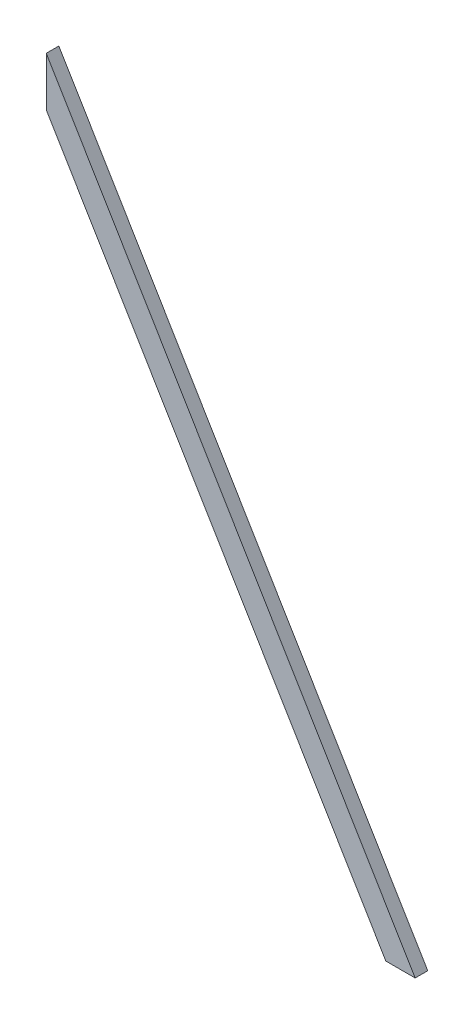
ISO-10303-21;
HEADER;
FILE_DESCRIPTION(('STEP AP214'),'2;1');
FILE_NAME('part.step','',(''),(''),'','','');
FILE_SCHEMA(('AUTOMOTIVE_DESIGN { 1 0 10303 214 1 1 1 1 }'));
ENDSEC;
DATA;
#1=APPLICATION_CONTEXT('core data for automotive mechanical design processes');
#2=APPLICATION_PROTOCOL_DEFINITION('international standard','automotive_design',2000,#1);
#3=PRODUCT_CONTEXT('',#1,'mechanical');
#4=PRODUCT('Part','Part','',(#3));
#5=PRODUCT_RELATED_PRODUCT_CATEGORY('part','',(#4));
#6=PRODUCT_DEFINITION_FORMATION('','',#4);
#7=PRODUCT_DEFINITION_CONTEXT('part definition',#1,'design');
#8=PRODUCT_DEFINITION('design','',#6,#7);
#9=PRODUCT_DEFINITION_SHAPE('','',#8);
#10=(LENGTH_UNIT() NAMED_UNIT(*) SI_UNIT(.MILLI.,.METRE.));
#11=(NAMED_UNIT(*) PLANE_ANGLE_UNIT() SI_UNIT($,.RADIAN.));
#12=(NAMED_UNIT(*) SI_UNIT($,.STERADIAN.) SOLID_ANGLE_UNIT());
#13=UNCERTAINTY_MEASURE_WITH_UNIT(LENGTH_MEASURE(1.E-05),#10,'distance_accuracy_value','');
#14=(GEOMETRIC_REPRESENTATION_CONTEXT(3) GLOBAL_UNCERTAINTY_ASSIGNED_CONTEXT((#13)) GLOBAL_UNIT_ASSIGNED_CONTEXT((#10,
#11,#12)) REPRESENTATION_CONTEXT('',''));
#15=CARTESIAN_POINT('',(0.,0.,0.));
#16=DIRECTION('',(0.,0.,1.));
#17=DIRECTION('',(1.,0.,0.));
#18=AXIS2_PLACEMENT_3D('',#15,#16,#17);
#19=CARTESIAN_POINT('',(-18.796,933.686763033529,-19.05));
#20=DIRECTION('',(-1.,0.,0.));
#21=DIRECTION('',(0.,0.,1.));
#22=AXIS2_PLACEMENT_3D('',#19,#20,#21);
#23=PLANE('',#22);
#24=DIRECTION('',(0.,-1.,0.));
#25=VECTOR('',#24,1.);
#26=CARTESIAN_POINT('',(-18.796,933.686763033529,0.));
#27=LINE('',#26,#25);
#28=CARTESIAN_POINT('',(-18.796,933.686763033529,0.));
#29=VERTEX_POINT('',#28);
#30=CARTESIAN_POINT('',(-18.796,859.496033764355,0.));
#31=VERTEX_POINT('',#30);
#32=EDGE_CURVE('E111',#29,#31,#27,.T.);
#33=ORIENTED_EDGE('',*,*,#32,.F.);
#34=DIRECTION('',(0.,0.,1.));
#35=VECTOR('',#34,1.);
#36=CARTESIAN_POINT('',(-18.796,933.686763033529,-19.05));
#37=LINE('',#36,#35);
#38=CARTESIAN_POINT('',(-18.796,933.686763033529,-19.05));
#39=VERTEX_POINT('',#38);
#40=EDGE_CURVE('E11',#39,#29,#37,.T.);
#41=ORIENTED_EDGE('',*,*,#40,.F.);
#42=DIRECTION('',(0.,-1.,0.));
#43=VECTOR('',#42,1.);
#44=CARTESIAN_POINT('',(-18.796,933.686763033529,-19.05));
#45=LINE('',#44,#43);
#46=CARTESIAN_POINT('',(-18.796,859.496033764355,-19.05));
#47=VERTEX_POINT('',#46);
#48=EDGE_CURVE('E103',#39,#47,#45,.T.);
#49=ORIENTED_EDGE('',*,*,#48,.T.);
#50=DIRECTION('',(0.,0.,1.));
#51=VECTOR('',#50,1.);
#52=CARTESIAN_POINT('',(-18.796,859.496033764355,-19.05));
#53=LINE('',#52,#51);
#54=EDGE_CURVE('E44',#47,#31,#53,.T.);
#55=ORIENTED_EDGE('',*,*,#54,.T.);
#56=EDGE_LOOP('',(#33,#41,#49,#55));
#57=FACE_BOUND('',#56,.T.);
#58=ADVANCED_FACE('F41',(#57),#23,.T.);
#59=CARTESIAN_POINT('',(540.004,0.,-19.05));
#60=DIRECTION('',(0.858064905723647,0.513541252058165,0.));
#61=DIRECTION('',(-0.513541252058165,0.858064905723647,0.));
#62=AXIS2_PLACEMENT_3D('',#59,#60,#61);
#63=PLANE('',#62);
#64=DIRECTION('',(-0.513541252058165,0.858064905723647,0.));
#65=VECTOR('',#64,1.);
#66=CARTESIAN_POINT('',(540.004,0.,0.));
#67=LINE('',#66,#65);
#68=CARTESIAN_POINT('',(540.004,0.,0.));
#69=VERTEX_POINT('',#68);
#70=EDGE_CURVE('E106',#69,#29,#67,.T.);
#71=ORIENTED_EDGE('',*,*,#70,.F.);
#72=DIRECTION('',(0.,0.,1.));
#73=VECTOR('',#72,1.);
#74=CARTESIAN_POINT('',(540.004,0.,-19.05));
#75=LINE('',#74,#73);
#76=CARTESIAN_POINT('',(540.004,0.,-19.05));
#77=VERTEX_POINT('',#76);
#78=EDGE_CURVE('E51',#77,#69,#75,.T.);
#79=ORIENTED_EDGE('',*,*,#78,.F.);
#80=DIRECTION('',(-0.513541252058165,0.858064905723647,0.));
#81=VECTOR('',#80,1.);
#82=CARTESIAN_POINT('',(540.004,0.,-19.05));
#83=LINE('',#82,#81);
#84=EDGE_CURVE('E98',#77,#39,#83,.T.);
#85=ORIENTED_EDGE('',*,*,#84,.T.);
#86=ORIENTED_EDGE('',*,*,#40,.T.);
#87=EDGE_LOOP('',(#71,#79,#85,#86));
#88=FACE_BOUND('',#87,.T.);
#89=ADVANCED_FACE('F127',(#88),#63,.T.);
#90=CARTESIAN_POINT('',(495.601764521241,0.,-19.05));
#91=DIRECTION('',(0.,-1.,0.));
#92=DIRECTION('',(0.,0.,-1.));
#93=AXIS2_PLACEMENT_3D('',#90,#91,#92);
#94=PLANE('',#93);
#95=DIRECTION('',(1.,0.,0.));
#96=VECTOR('',#95,1.);
#97=CARTESIAN_POINT('',(495.601764521241,0.,0.));
#98=LINE('',#97,#96);
#99=CARTESIAN_POINT('',(495.601764521241,0.,0.));
#100=VERTEX_POINT('',#99);
#101=EDGE_CURVE('E92',#100,#69,#98,.T.);
#102=ORIENTED_EDGE('',*,*,#101,.F.);
#103=DIRECTION('',(0.,0.,1.));
#104=VECTOR('',#103,1.);
#105=CARTESIAN_POINT('',(495.601764521241,0.,-19.05));
#106=LINE('',#105,#104);
#107=CARTESIAN_POINT('',(495.601764521241,0.,-19.05));
#108=VERTEX_POINT('',#107);
#109=EDGE_CURVE('E87',#108,#100,#106,.T.);
#110=ORIENTED_EDGE('',*,*,#109,.F.);
#111=DIRECTION('',(1.,0.,0.));
#112=VECTOR('',#111,1.);
#113=CARTESIAN_POINT('',(495.601764521241,0.,-19.05));
#114=LINE('',#113,#112);
#115=EDGE_CURVE('E90',#108,#77,#114,.T.);
#116=ORIENTED_EDGE('',*,*,#115,.T.);
#117=ORIENTED_EDGE('',*,*,#78,.T.);
#118=EDGE_LOOP('',(#102,#110,#116,#117));
#119=FACE_BOUND('',#118,.T.);
#120=ADVANCED_FACE('F89',(#119),#94,.T.);
#121=CARTESIAN_POINT('',(-18.796,859.496033764355,-19.05));
#122=DIRECTION('',(-0.858064905723648,-0.513541252058165,0.));
#123=DIRECTION('',(0.513541252058165,-0.858064905723648,0.));
#124=AXIS2_PLACEMENT_3D('',#121,#122,#123);
#125=PLANE('',#124);
#126=DIRECTION('',(0.513541252058165,-0.858064905723647,0.));
#127=VECTOR('',#126,1.);
#128=CARTESIAN_POINT('',(-18.796,859.496033764355,0.));
#129=LINE('',#128,#127);
#130=EDGE_CURVE('E115',#31,#100,#129,.T.);
#131=ORIENTED_EDGE('',*,*,#130,.F.);
#132=ORIENTED_EDGE('',*,*,#54,.F.);
#133=DIRECTION('',(0.513541252058165,-0.858064905723647,0.));
#134=VECTOR('',#133,1.);
#135=CARTESIAN_POINT('',(-18.796,859.496033764355,-19.05));
#136=LINE('',#135,#134);
#137=EDGE_CURVE('E97',#47,#108,#136,.T.);
#138=ORIENTED_EDGE('',*,*,#137,.T.);
#139=ORIENTED_EDGE('',*,*,#109,.T.);
#140=EDGE_LOOP('',(#131,#132,#138,#139));
#141=FACE_BOUND('',#140,.T.);
#142=ADVANCED_FACE('F101',(#141),#125,.T.);
#143=CARTESIAN_POINT('',(0.,0.,-19.05));
#144=DIRECTION('',(0.,0.,1.));
#145=DIRECTION('',(1.,0.,0.));
#146=AXIS2_PLACEMENT_3D('',#143,#144,#145);
#147=PLANE('',#146);
#148=ORIENTED_EDGE('',*,*,#48,.F.);
#149=ORIENTED_EDGE('',*,*,#84,.F.);
#150=ORIENTED_EDGE('',*,*,#115,.F.);
#151=ORIENTED_EDGE('',*,*,#137,.F.);
#152=EDGE_LOOP('',(#148,#149,#150,#151));
#153=FACE_BOUND('',#152,.T.);
#154=ADVANCED_FACE('F96',(#153),#147,.F.);
#155=CARTESIAN_POINT('',(0.,0.,0.));
#156=DIRECTION('',(0.,0.,1.));
#157=DIRECTION('',(1.,0.,0.));
#158=AXIS2_PLACEMENT_3D('',#155,#156,#157);
#159=PLANE('',#158);
#160=ORIENTED_EDGE('',*,*,#32,.T.);
#161=ORIENTED_EDGE('',*,*,#130,.T.);
#162=ORIENTED_EDGE('',*,*,#101,.T.);
#163=ORIENTED_EDGE('',*,*,#70,.T.);
#164=EDGE_LOOP('',(#160,#161,#162,#163));
#165=FACE_BOUND('',#164,.T.);
#166=ADVANCED_FACE('F126',(#165),#159,.T.);
#167=CLOSED_SHELL('',(#58,#89,#120,#142,#154,#166));
#168=MANIFOLD_SOLID_BREP('B2',#167);
#169=ADVANCED_BREP_SHAPE_REPRESENTATION('',(#18,#168),#14);
#170=SHAPE_DEFINITION_REPRESENTATION(#9,#169);
ENDSEC;
END-ISO-10303-21;
